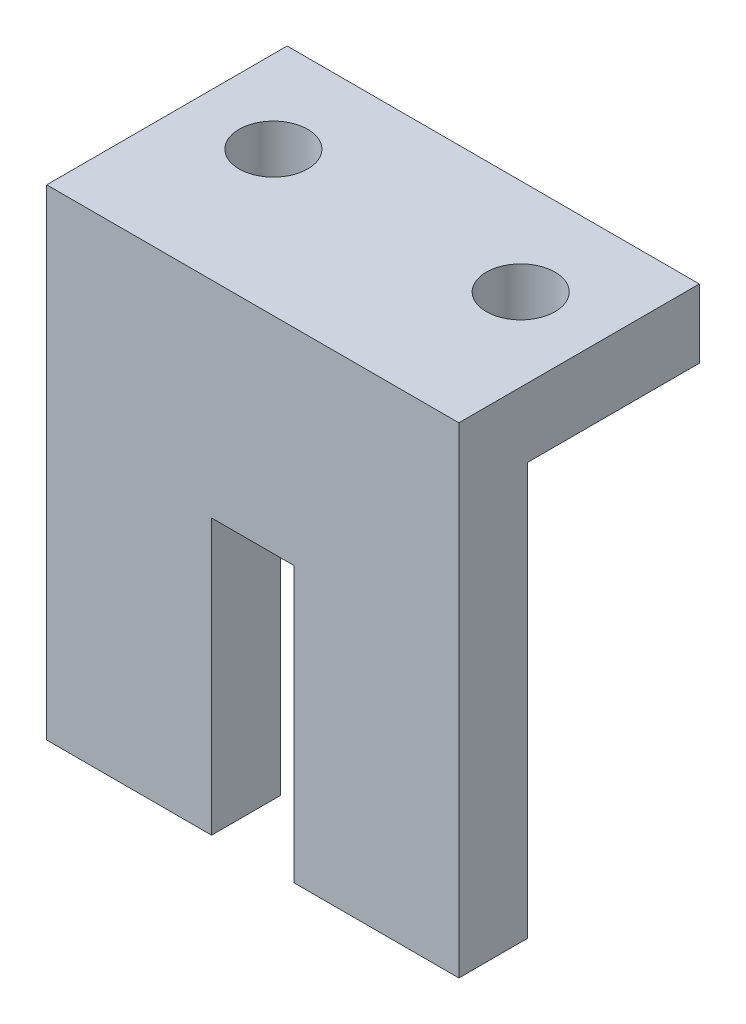
ISO-10303-21;
HEADER;
FILE_DESCRIPTION(('STEP AP214'),'2;1');
FILE_NAME('part.step','',(''),(''),'','','');
FILE_SCHEMA(('AUTOMOTIVE_DESIGN { 1 0 10303 214 1 1 1 1 }'));
ENDSEC;
DATA;
#1=APPLICATION_CONTEXT('core data for automotive mechanical design processes');
#2=APPLICATION_PROTOCOL_DEFINITION('international standard','automotive_design',2000,#1);
#3=PRODUCT_CONTEXT('',#1,'mechanical');
#4=PRODUCT('Part','Part','',(#3));
#5=PRODUCT_RELATED_PRODUCT_CATEGORY('part','',(#4));
#6=PRODUCT_DEFINITION_FORMATION('','',#4);
#7=PRODUCT_DEFINITION_CONTEXT('part definition',#1,'design');
#8=PRODUCT_DEFINITION('design','',#6,#7);
#9=PRODUCT_DEFINITION_SHAPE('','',#8);
#10=(LENGTH_UNIT() NAMED_UNIT(*) SI_UNIT(.MILLI.,.METRE.));
#11=(NAMED_UNIT(*) PLANE_ANGLE_UNIT() SI_UNIT($,.RADIAN.));
#12=(NAMED_UNIT(*) SI_UNIT($,.STERADIAN.) SOLID_ANGLE_UNIT());
#13=UNCERTAINTY_MEASURE_WITH_UNIT(LENGTH_MEASURE(1.E-05),#10,'distance_accuracy_value','');
#14=(GEOMETRIC_REPRESENTATION_CONTEXT(3) GLOBAL_UNCERTAINTY_ASSIGNED_CONTEXT((#13)) GLOBAL_UNIT_ASSIGNED_CONTEXT((#10,
#11,#12)) REPRESENTATION_CONTEXT('',''));
#15=CARTESIAN_POINT('',(0.,0.,0.));
#16=DIRECTION('',(0.,0.,1.));
#17=DIRECTION('',(1.,0.,0.));
#18=AXIS2_PLACEMENT_3D('',#15,#16,#17);
#19=CARTESIAN_POINT('',(0.,0.,5.));
#20=DIRECTION('',(0.,1.,0.));
#21=DIRECTION('',(0.,0.,1.));
#22=AXIS2_PLACEMENT_3D('',#19,#20,#21);
#23=PLANE('',#22);
#24=DIRECTION('',(1.,0.,0.));
#25=VECTOR('',#24,1.);
#26=CARTESIAN_POINT('',(0.,0.,0.));
#27=LINE('',#26,#25);
#28=CARTESIAN_POINT('',(0.,0.,0.));
#29=VERTEX_POINT('',#28);
#30=CARTESIAN_POINT('',(12.,0.,0.));
#31=VERTEX_POINT('',#30);
#32=EDGE_CURVE('E194',#29,#31,#27,.T.);
#33=ORIENTED_EDGE('',*,*,#32,.T.);
#34=DIRECTION('',(0.,0.,-1.));
#35=VECTOR('',#34,1.);
#36=CARTESIAN_POINT('',(12.,0.,5.));
#37=LINE('',#36,#35);
#38=CARTESIAN_POINT('',(12.,0.,5.));
#39=VERTEX_POINT('',#38);
#40=EDGE_CURVE('E166',#39,#31,#37,.T.);
#41=ORIENTED_EDGE('',*,*,#40,.F.);
#42=DIRECTION('',(1.,0.,0.));
#43=VECTOR('',#42,1.);
#44=CARTESIAN_POINT('',(0.,0.,5.));
#45=LINE('',#44,#43);
#46=CARTESIAN_POINT('',(0.,0.,5.));
#47=VERTEX_POINT('',#46);
#48=EDGE_CURVE('E197',#47,#39,#45,.T.);
#49=ORIENTED_EDGE('',*,*,#48,.F.);
#50=DIRECTION('',(0.,0.,-1.));
#51=VECTOR('',#50,1.);
#52=CARTESIAN_POINT('',(0.,0.,5.));
#53=LINE('',#52,#51);
#54=EDGE_CURVE('E47',#47,#29,#53,.T.);
#55=ORIENTED_EDGE('',*,*,#54,.T.);
#56=EDGE_LOOP('',(#33,#41,#49,#55));
#57=FACE_BOUND('',#56,.T.);
#58=ADVANCED_FACE('F39',(#57),#23,.F.);
#59=CARTESIAN_POINT('',(12.,0.,5.));
#60=DIRECTION('',(-1.,0.,0.));
#61=DIRECTION('',(0.,0.,1.));
#62=AXIS2_PLACEMENT_3D('',#59,#60,#61);
#63=PLANE('',#62);
#64=DIRECTION('',(0.,1.,0.));
#65=VECTOR('',#64,1.);
#66=CARTESIAN_POINT('',(12.,0.,0.));
#67=LINE('',#66,#65);
#68=CARTESIAN_POINT('',(12.,20.,0.));
#69=VERTEX_POINT('',#68);
#70=EDGE_CURVE('E216',#31,#69,#67,.T.);
#71=ORIENTED_EDGE('',*,*,#70,.T.);
#72=DIRECTION('',(0.,0.,-1.));
#73=VECTOR('',#72,1.);
#74=CARTESIAN_POINT('',(12.,20.,5.));
#75=LINE('',#74,#73);
#76=CARTESIAN_POINT('',(12.,20.,5.));
#77=VERTEX_POINT('',#76);
#78=EDGE_CURVE('E162',#77,#69,#75,.T.);
#79=ORIENTED_EDGE('',*,*,#78,.F.);
#80=DIRECTION('',(0.,1.,0.));
#81=VECTOR('',#80,1.);
#82=CARTESIAN_POINT('',(12.,0.,5.));
#83=LINE('',#82,#81);
#84=EDGE_CURVE('E200',#39,#77,#83,.T.);
#85=ORIENTED_EDGE('',*,*,#84,.F.);
#86=ORIENTED_EDGE('',*,*,#40,.T.);
#87=EDGE_LOOP('',(#71,#79,#85,#86));
#88=FACE_BOUND('',#87,.T.);
#89=ADVANCED_FACE('F279',(#88),#63,.F.);
#90=CARTESIAN_POINT('',(12.,20.,5.));
#91=DIRECTION('',(0.,1.,0.));
#92=DIRECTION('',(0.,0.,1.));
#93=AXIS2_PLACEMENT_3D('',#90,#91,#92);
#94=PLANE('',#93);
#95=DIRECTION('',(1.,0.,0.));
#96=VECTOR('',#95,1.);
#97=CARTESIAN_POINT('',(12.,20.,0.));
#98=LINE('',#97,#96);
#99=CARTESIAN_POINT('',(18.,20.,0.));
#100=VERTEX_POINT('',#99);
#101=EDGE_CURVE('E219',#69,#100,#98,.T.);
#102=ORIENTED_EDGE('',*,*,#101,.T.);
#103=DIRECTION('',(0.,0.,-1.));
#104=VECTOR('',#103,1.);
#105=CARTESIAN_POINT('',(18.,20.,5.));
#106=LINE('',#105,#104);
#107=CARTESIAN_POINT('',(18.,20.,5.));
#108=VERTEX_POINT('',#107);
#109=EDGE_CURVE('E158',#108,#100,#106,.T.);
#110=ORIENTED_EDGE('',*,*,#109,.F.);
#111=DIRECTION('',(1.,0.,0.));
#112=VECTOR('',#111,1.);
#113=CARTESIAN_POINT('',(12.,20.,5.));
#114=LINE('',#113,#112);
#115=EDGE_CURVE('E203',#77,#108,#114,.T.);
#116=ORIENTED_EDGE('',*,*,#115,.F.);
#117=ORIENTED_EDGE('',*,*,#78,.T.);
#118=EDGE_LOOP('',(#102,#110,#116,#117));
#119=FACE_BOUND('',#118,.T.);
#120=ADVANCED_FACE('F283',(#119),#94,.F.);
#121=CARTESIAN_POINT('',(18.,20.,5.));
#122=DIRECTION('',(1.,0.,0.));
#123=DIRECTION('',(0.,1.,0.));
#124=AXIS2_PLACEMENT_3D('',#121,#122,#123);
#125=PLANE('',#124);
#126=DIRECTION('',(0.,-1.,0.));
#127=VECTOR('',#126,1.);
#128=CARTESIAN_POINT('',(18.,20.,0.));
#129=LINE('',#128,#127);
#130=CARTESIAN_POINT('',(18.,0.,0.));
#131=VERTEX_POINT('',#130);
#132=EDGE_CURVE('E222',#100,#131,#129,.T.);
#133=ORIENTED_EDGE('',*,*,#132,.T.);
#134=DIRECTION('',(0.,0.,-1.));
#135=VECTOR('',#134,1.);
#136=CARTESIAN_POINT('',(18.,0.,5.));
#137=LINE('',#136,#135);
#138=CARTESIAN_POINT('',(18.,0.,5.));
#139=VERTEX_POINT('',#138);
#140=EDGE_CURVE('E154',#139,#131,#137,.T.);
#141=ORIENTED_EDGE('',*,*,#140,.F.);
#142=DIRECTION('',(0.,-1.,0.));
#143=VECTOR('',#142,1.);
#144=CARTESIAN_POINT('',(18.,20.,5.));
#145=LINE('',#144,#143);
#146=EDGE_CURVE('E206',#108,#139,#145,.T.);
#147=ORIENTED_EDGE('',*,*,#146,.F.);
#148=ORIENTED_EDGE('',*,*,#109,.T.);
#149=EDGE_LOOP('',(#133,#141,#147,#148));
#150=FACE_BOUND('',#149,.T.);
#151=ADVANCED_FACE('F288',(#150),#125,.F.);
#152=CARTESIAN_POINT('',(18.,0.,5.));
#153=DIRECTION('',(0.,1.,0.));
#154=DIRECTION('',(0.,0.,1.));
#155=AXIS2_PLACEMENT_3D('',#152,#153,#154);
#156=PLANE('',#155);
#157=DIRECTION('',(1.,0.,0.));
#158=VECTOR('',#157,1.);
#159=CARTESIAN_POINT('',(18.,0.,0.));
#160=LINE('',#159,#158);
#161=CARTESIAN_POINT('',(30.,0.,0.));
#162=VERTEX_POINT('',#161);
#163=EDGE_CURVE('E225',#131,#162,#160,.T.);
#164=ORIENTED_EDGE('',*,*,#163,.T.);
#165=DIRECTION('',(0.,0.,-1.));
#166=VECTOR('',#165,1.);
#167=CARTESIAN_POINT('',(30.,0.,5.));
#168=LINE('',#167,#166);
#169=CARTESIAN_POINT('',(30.,0.,5.));
#170=VERTEX_POINT('',#169);
#171=EDGE_CURVE('E143',#170,#162,#168,.T.);
#172=ORIENTED_EDGE('',*,*,#171,.F.);
#173=DIRECTION('',(1.,0.,0.));
#174=VECTOR('',#173,1.);
#175=CARTESIAN_POINT('',(18.,0.,5.));
#176=LINE('',#175,#174);
#177=EDGE_CURVE('E209',#139,#170,#176,.T.);
#178=ORIENTED_EDGE('',*,*,#177,.F.);
#179=ORIENTED_EDGE('',*,*,#140,.T.);
#180=EDGE_LOOP('',(#164,#172,#178,#179));
#181=FACE_BOUND('',#180,.T.);
#182=ADVANCED_FACE('F294',(#181),#156,.F.);
#183=CARTESIAN_POINT('',(30.,35.,5.));
#184=DIRECTION('',(-1.,0.,0.));
#185=DIRECTION('',(0.,0.,1.));
#186=AXIS2_PLACEMENT_3D('',#183,#184,#185);
#187=PLANE('',#186);
#188=DIRECTION('',(0.,0.,1.));
#189=VECTOR('',#188,1.);
#190=CARTESIAN_POINT('',(30.,30.,-19.));
#191=LINE('',#190,#189);
#192=CARTESIAN_POINT('',(30.,30.,-12.5));
#193=VERTEX_POINT('',#192);
#194=CARTESIAN_POINT('',(30.,30.,0.));
#195=VERTEX_POINT('',#194);
#196=EDGE_CURVE('E60',#193,#195,#191,.T.);
#197=ORIENTED_EDGE('',*,*,#196,.F.);
#198=DIRECTION('',(0.,1.,0.));
#199=VECTOR('',#198,1.);
#200=CARTESIAN_POINT('',(30.,0.,-12.5));
#201=LINE('',#200,#199);
#202=CARTESIAN_POINT('',(30.,35.,-12.5));
#203=VERTEX_POINT('',#202);
#204=EDGE_CURVE('E54',#193,#203,#201,.T.);
#205=ORIENTED_EDGE('',*,*,#204,.T.);
#206=DIRECTION('',(0.,0.,-1.));
#207=VECTOR('',#206,1.);
#208=CARTESIAN_POINT('',(30.,35.,5.));
#209=LINE('',#208,#207);
#210=CARTESIAN_POINT('',(30.,35.,5.));
#211=VERTEX_POINT('',#210);
#212=EDGE_CURVE('E130',#211,#203,#209,.T.);
#213=ORIENTED_EDGE('',*,*,#212,.F.);
#214=DIRECTION('',(0.,1.,0.));
#215=VECTOR('',#214,1.);
#216=CARTESIAN_POINT('',(30.,0.,5.));
#217=LINE('',#216,#215);
#218=EDGE_CURVE('E145',#170,#211,#217,.T.);
#219=ORIENTED_EDGE('',*,*,#218,.F.);
#220=ORIENTED_EDGE('',*,*,#171,.T.);
#221=DIRECTION('',(0.,1.,0.));
#222=VECTOR('',#221,1.);
#223=CARTESIAN_POINT('',(30.,35.,0.));
#224=LINE('',#223,#222);
#225=EDGE_CURVE('E228',#162,#195,#224,.T.);
#226=ORIENTED_EDGE('',*,*,#225,.T.);
#227=EDGE_LOOP('',(#197,#205,#213,#219,#220,#226));
#228=FACE_BOUND('',#227,.T.);
#229=ADVANCED_FACE('F247',(#228),#187,.F.);
#230=CARTESIAN_POINT('',(0.,35.,5.));
#231=DIRECTION('',(0.,-1.,0.));
#232=DIRECTION('',(0.,0.,-1.));
#233=AXIS2_PLACEMENT_3D('',#230,#231,#232);
#234=PLANE('',#233);
#235=CARTESIAN_POINT('',(24.,35.,-5.5));
#236=DIRECTION('',(0.,1.,0.));
#237=DIRECTION('',(0.,0.,1.));
#238=AXIS2_PLACEMENT_3D('',#235,#236,#237);
#239=CIRCLE('',#238,2.5);
#240=CARTESIAN_POINT('',(24.,35.,-3.));
#241=VERTEX_POINT('',#240);
#242=EDGE_CURVE('E177',#241,#241,#239,.T.);
#243=ORIENTED_EDGE('',*,*,#242,.F.);
#244=EDGE_LOOP('',(#243));
#245=FACE_BOUND('',#244,.T.);
#246=CARTESIAN_POINT('',(6.,35.,-5.5));
#247=DIRECTION('',(0.,1.,0.));
#248=DIRECTION('',(0.,0.,1.));
#249=AXIS2_PLACEMENT_3D('',#246,#247,#248);
#250=CIRCLE('',#249,2.5);
#251=CARTESIAN_POINT('',(6.,35.,-3.));
#252=VERTEX_POINT('',#251);
#253=EDGE_CURVE('E189',#252,#252,#250,.T.);
#254=ORIENTED_EDGE('',*,*,#253,.F.);
#255=EDGE_LOOP('',(#254));
#256=FACE_BOUND('',#255,.T.);
#257=ORIENTED_EDGE('',*,*,#212,.T.);
#258=DIRECTION('',(1.,0.,0.));
#259=VECTOR('',#258,1.);
#260=CARTESIAN_POINT('',(0.,35.,-12.5));
#261=LINE('',#260,#259);
#262=CARTESIAN_POINT('',(0.,35.,-12.5));
#263=VERTEX_POINT('',#262);
#264=EDGE_CURVE('E117',#263,#203,#261,.T.);
#265=ORIENTED_EDGE('',*,*,#264,.F.);
#266=DIRECTION('',(0.,0.,-1.));
#267=VECTOR('',#266,1.);
#268=CARTESIAN_POINT('',(0.,35.,5.));
#269=LINE('',#268,#267);
#270=CARTESIAN_POINT('',(0.,35.,5.));
#271=VERTEX_POINT('',#270);
#272=EDGE_CURVE('E128',#271,#263,#269,.T.);
#273=ORIENTED_EDGE('',*,*,#272,.F.);
#274=DIRECTION('',(-1.,0.,0.));
#275=VECTOR('',#274,1.);
#276=CARTESIAN_POINT('',(0.,35.,5.));
#277=LINE('',#276,#275);
#278=EDGE_CURVE('E139',#211,#271,#277,.T.);
#279=ORIENTED_EDGE('',*,*,#278,.F.);
#280=EDGE_LOOP('',(#257,#265,#273,#279));
#281=FACE_BOUND('',#280,.T.);
#282=ADVANCED_FACE('F126',(#245,#256,#281),#234,.F.);
#283=CARTESIAN_POINT('',(0.,30.,5.));
#284=DIRECTION('',(1.,0.,0.));
#285=DIRECTION('',(0.,0.,-1.));
#286=AXIS2_PLACEMENT_3D('',#283,#284,#285);
#287=PLANE('',#286);
#288=ORIENTED_EDGE('',*,*,#272,.T.);
#289=DIRECTION('',(0.,1.,0.));
#290=VECTOR('',#289,1.);
#291=CARTESIAN_POINT('',(0.,0.,-12.5));
#292=LINE('',#291,#290);
#293=CARTESIAN_POINT('',(0.,30.,-12.5));
#294=VERTEX_POINT('',#293);
#295=EDGE_CURVE('E114',#294,#263,#292,.T.);
#296=ORIENTED_EDGE('',*,*,#295,.F.);
#297=DIRECTION('',(0.,0.,1.));
#298=VECTOR('',#297,1.);
#299=CARTESIAN_POINT('',(0.,30.,-19.));
#300=LINE('',#299,#298);
#301=CARTESIAN_POINT('',(0.,30.,0.));
#302=VERTEX_POINT('',#301);
#303=EDGE_CURVE('E184',#294,#302,#300,.T.);
#304=ORIENTED_EDGE('',*,*,#303,.T.);
#305=DIRECTION('',(0.,-1.,0.));
#306=VECTOR('',#305,1.);
#307=CARTESIAN_POINT('',(0.,30.,0.));
#308=LINE('',#307,#306);
#309=EDGE_CURVE('E148',#302,#29,#308,.T.);
#310=ORIENTED_EDGE('',*,*,#309,.T.);
#311=ORIENTED_EDGE('',*,*,#54,.F.);
#312=DIRECTION('',(0.,-1.,0.));
#313=VECTOR('',#312,1.);
#314=CARTESIAN_POINT('',(0.,0.,5.));
#315=LINE('',#314,#313);
#316=EDGE_CURVE('E136',#271,#47,#315,.T.);
#317=ORIENTED_EDGE('',*,*,#316,.F.);
#318=EDGE_LOOP('',(#288,#296,#304,#310,#311,#317));
#319=FACE_BOUND('',#318,.T.);
#320=ADVANCED_FACE('F133',(#319),#287,.F.);
#321=CARTESIAN_POINT('',(0.,0.,5.));
#322=DIRECTION('',(0.,0.,-1.));
#323=DIRECTION('',(-1.,0.,0.));
#324=AXIS2_PLACEMENT_3D('',#321,#322,#323);
#325=PLANE('',#324);
#326=ORIENTED_EDGE('',*,*,#316,.T.);
#327=ORIENTED_EDGE('',*,*,#48,.T.);
#328=ORIENTED_EDGE('',*,*,#84,.T.);
#329=ORIENTED_EDGE('',*,*,#115,.T.);
#330=ORIENTED_EDGE('',*,*,#146,.T.);
#331=ORIENTED_EDGE('',*,*,#177,.T.);
#332=ORIENTED_EDGE('',*,*,#218,.T.);
#333=ORIENTED_EDGE('',*,*,#278,.T.);
#334=EDGE_LOOP('',(#326,#327,#328,#329,#330,#331,#332,#333));
#335=FACE_BOUND('',#334,.T.);
#336=ADVANCED_FACE('F243',(#335),#325,.F.);
#337=CARTESIAN_POINT('',(0.,0.,0.));
#338=DIRECTION('',(0.,0.,-1.));
#339=DIRECTION('',(-1.,0.,0.));
#340=AXIS2_PLACEMENT_3D('',#337,#338,#339);
#341=PLANE('',#340);
#342=DIRECTION('',(-1.,0.,0.));
#343=VECTOR('',#342,1.);
#344=CARTESIAN_POINT('',(30.,30.,0.));
#345=LINE('',#344,#343);
#346=EDGE_CURVE('E180',#195,#302,#345,.T.);
#347=ORIENTED_EDGE('',*,*,#346,.F.);
#348=ORIENTED_EDGE('',*,*,#225,.F.);
#349=ORIENTED_EDGE('',*,*,#163,.F.);
#350=ORIENTED_EDGE('',*,*,#132,.F.);
#351=ORIENTED_EDGE('',*,*,#101,.F.);
#352=ORIENTED_EDGE('',*,*,#70,.F.);
#353=ORIENTED_EDGE('',*,*,#32,.F.);
#354=ORIENTED_EDGE('',*,*,#309,.F.);
#355=EDGE_LOOP('',(#347,#348,#349,#350,#351,#352,#353,#354));
#356=FACE_BOUND('',#355,.T.);
#357=ADVANCED_FACE('F237',(#356),#341,.T.);
#358=CARTESIAN_POINT('',(30.,30.,-19.));
#359=DIRECTION('',(0.,1.,0.));
#360=DIRECTION('',(0.,0.,1.));
#361=AXIS2_PLACEMENT_3D('',#358,#359,#360);
#362=PLANE('',#361);
#363=CARTESIAN_POINT('',(24.,30.,-5.5));
#364=DIRECTION('',(0.,1.,0.));
#365=DIRECTION('',(0.,0.,1.));
#366=AXIS2_PLACEMENT_3D('',#363,#364,#365);
#367=CIRCLE('',#366,2.5);
#368=CARTESIAN_POINT('',(24.,30.,-3.));
#369=VERTEX_POINT('',#368);
#370=EDGE_CURVE('E176',#369,#369,#367,.T.);
#371=ORIENTED_EDGE('',*,*,#370,.T.);
#372=EDGE_LOOP('',(#371));
#373=FACE_BOUND('',#372,.T.);
#374=CARTESIAN_POINT('',(6.,30.,-5.5));
#375=DIRECTION('',(0.,1.,0.));
#376=DIRECTION('',(0.,0.,1.));
#377=AXIS2_PLACEMENT_3D('',#374,#375,#376);
#378=CIRCLE('',#377,2.5);
#379=CARTESIAN_POINT('',(6.,30.,-3.));
#380=VERTEX_POINT('',#379);
#381=EDGE_CURVE('E173',#380,#380,#378,.T.);
#382=ORIENTED_EDGE('',*,*,#381,.T.);
#383=EDGE_LOOP('',(#382));
#384=FACE_BOUND('',#383,.T.);
#385=ORIENTED_EDGE('',*,*,#303,.F.);
#386=DIRECTION('',(1.,0.,0.));
#387=VECTOR('',#386,1.);
#388=CARTESIAN_POINT('',(30.,30.,-12.5));
#389=LINE('',#388,#387);
#390=EDGE_CURVE('E11',#294,#193,#389,.T.);
#391=ORIENTED_EDGE('',*,*,#390,.T.);
#392=ORIENTED_EDGE('',*,*,#196,.T.);
#393=ORIENTED_EDGE('',*,*,#346,.T.);
#394=EDGE_LOOP('',(#385,#391,#392,#393));
#395=FACE_BOUND('',#394,.T.);
#396=ADVANCED_FACE('F267',(#373,#384,#395),#362,.F.);
#397=CARTESIAN_POINT('',(6.,16.,-5.5));
#398=DIRECTION('',(0.,1.,0.));
#399=DIRECTION('',(0.,0.,1.));
#400=AXIS2_PLACEMENT_3D('',#397,#398,#399);
#401=CYLINDRICAL_SURFACE('',#400,2.5);
#402=ORIENTED_EDGE('',*,*,#253,.T.);
#403=EDGE_LOOP('',(#402));
#404=FACE_BOUND('',#403,.T.);
#405=ORIENTED_EDGE('',*,*,#381,.F.);
#406=EDGE_LOOP('',(#405));
#407=FACE_BOUND('',#406,.T.);
#408=ADVANCED_FACE('F264',(#404,#407),#401,.F.);
#409=CARTESIAN_POINT('',(24.,16.,-5.5));
#410=DIRECTION('',(0.,1.,0.));
#411=DIRECTION('',(0.,0.,1.));
#412=AXIS2_PLACEMENT_3D('',#409,#410,#411);
#413=CYLINDRICAL_SURFACE('',#412,2.5);
#414=ORIENTED_EDGE('',*,*,#242,.T.);
#415=EDGE_LOOP('',(#414));
#416=FACE_BOUND('',#415,.T.);
#417=ORIENTED_EDGE('',*,*,#370,.F.);
#418=EDGE_LOOP('',(#417));
#419=FACE_BOUND('',#418,.T.);
#420=ADVANCED_FACE('F256',(#416,#419),#413,.F.);
#421=CARTESIAN_POINT('',(0.,0.,-12.5));
#422=DIRECTION('',(0.,0.,1.));
#423=DIRECTION('',(1.,0.,0.));
#424=AXIS2_PLACEMENT_3D('',#421,#422,#423);
#425=PLANE('',#424);
#426=ORIENTED_EDGE('',*,*,#295,.T.);
#427=ORIENTED_EDGE('',*,*,#264,.T.);
#428=ORIENTED_EDGE('',*,*,#204,.F.);
#429=ORIENTED_EDGE('',*,*,#390,.F.);
#430=EDGE_LOOP('',(#426,#427,#428,#429));
#431=FACE_BOUND('',#430,.T.);
#432=ADVANCED_FACE('F116',(#431),#425,.F.);
#433=CLOSED_SHELL('',(#58,#89,#120,#151,#182,#229,#282,#320,#336,#357,#396,#408,#420,#432));
#434=MANIFOLD_SOLID_BREP('B2',#433);
#435=ADVANCED_BREP_SHAPE_REPRESENTATION('',(#18,#434),#14);
#436=SHAPE_DEFINITION_REPRESENTATION(#9,#435);
ENDSEC;
END-ISO-10303-21;
